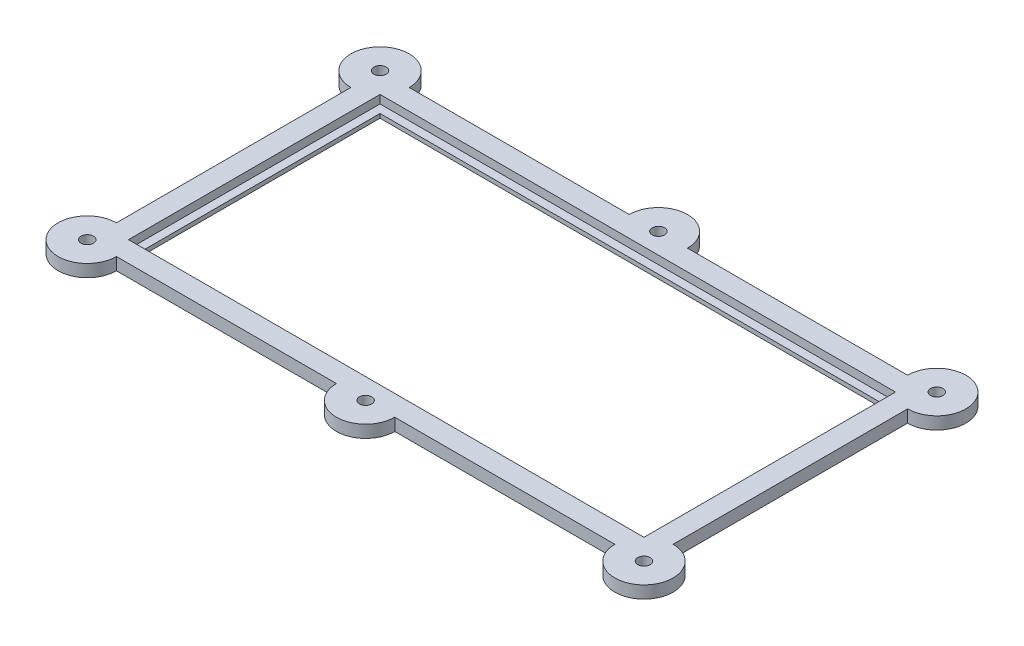
ISO-10303-21;
HEADER;
FILE_DESCRIPTION(('STEP AP214'),'2;1');
FILE_NAME('part.step','',(''),(''),'','','');
FILE_SCHEMA(('AUTOMOTIVE_DESIGN { 1 0 10303 214 1 1 1 1 }'));
ENDSEC;
DATA;
#1=APPLICATION_CONTEXT('core data for automotive mechanical design processes');
#2=APPLICATION_PROTOCOL_DEFINITION('international standard','automotive_design',2000,#1);
#3=PRODUCT_CONTEXT('',#1,'mechanical');
#4=PRODUCT('Part','Part','',(#3));
#5=PRODUCT_RELATED_PRODUCT_CATEGORY('part','',(#4));
#6=PRODUCT_DEFINITION_FORMATION('','',#4);
#7=PRODUCT_DEFINITION_CONTEXT('part definition',#1,'design');
#8=PRODUCT_DEFINITION('design','',#6,#7);
#9=PRODUCT_DEFINITION_SHAPE('','',#8);
#10=(LENGTH_UNIT() NAMED_UNIT(*) SI_UNIT(.MILLI.,.METRE.));
#11=(NAMED_UNIT(*) PLANE_ANGLE_UNIT() SI_UNIT($,.RADIAN.));
#12=(NAMED_UNIT(*) SI_UNIT($,.STERADIAN.) SOLID_ANGLE_UNIT());
#13=UNCERTAINTY_MEASURE_WITH_UNIT(LENGTH_MEASURE(1.E-05),#10,'distance_accuracy_value','');
#14=(GEOMETRIC_REPRESENTATION_CONTEXT(3) GLOBAL_UNCERTAINTY_ASSIGNED_CONTEXT((#13)) GLOBAL_UNIT_ASSIGNED_CONTEXT((#10,
#11,#12)) REPRESENTATION_CONTEXT('',''));
#15=CARTESIAN_POINT('',(0.,0.,0.));
#16=DIRECTION('',(0.,0.,1.));
#17=DIRECTION('',(1.,0.,0.));
#18=AXIS2_PLACEMENT_3D('',#15,#16,#17);
#19=CARTESIAN_POINT('',(33.75,1.,17.75));
#20=DIRECTION('',(0.,0.,-1.));
#21=DIRECTION('',(-1.,0.,0.));
#22=AXIS2_PLACEMENT_3D('',#19,#20,#21);
#23=PLANE('',#22);
#24=DIRECTION('',(-1.,0.,0.));
#25=VECTOR('',#24,1.);
#26=CARTESIAN_POINT('',(-33.75,-0.5,17.75));
#27=LINE('',#26,#25);
#28=CARTESIAN_POINT('',(-3.53553390593274,-0.5,17.75));
#29=VERTEX_POINT('',#28);
#30=CARTESIAN_POINT('',(-30.2144660940673,-0.5,17.75));
#31=VERTEX_POINT('',#30);
#32=EDGE_CURVE('E264',#29,#31,#27,.T.);
#33=ORIENTED_EDGE('',*,*,#32,.F.);
#34=DIRECTION('',(0.,1.,0.));
#35=VECTOR('',#34,1.);
#36=CARTESIAN_POINT('',(-3.53553390593274,-10.5,17.75));
#37=LINE('',#36,#35);
#38=CARTESIAN_POINT('',(-3.53553390593274,1.,17.75));
#39=VERTEX_POINT('',#38);
#40=EDGE_CURVE('E48',#29,#39,#37,.T.);
#41=ORIENTED_EDGE('',*,*,#40,.T.);
#42=DIRECTION('',(1.,0.,0.));
#43=VECTOR('',#42,1.);
#44=CARTESIAN_POINT('',(33.75,1.,17.75));
#45=LINE('',#44,#43);
#46=CARTESIAN_POINT('',(-30.2144660940673,1.,17.75));
#47=VERTEX_POINT('',#46);
#48=EDGE_CURVE('E186',#47,#39,#45,.T.);
#49=ORIENTED_EDGE('',*,*,#48,.F.);
#50=DIRECTION('',(0.,1.,0.));
#51=VECTOR('',#50,1.);
#52=CARTESIAN_POINT('',(-30.2144660940673,-10.5,17.75));
#53=LINE('',#52,#51);
#54=EDGE_CURVE('E362',#47,#31,#53,.F.);
#55=ORIENTED_EDGE('',*,*,#54,.T.);
#56=EDGE_LOOP('',(#33,#41,#49,#55));
#57=FACE_BOUND('',#56,.T.);
#58=ADVANCED_FACE('F33',(#57),#23,.F.);
#59=CARTESIAN_POINT('',(33.75,1.,-17.75));
#60=DIRECTION('',(0.,0.,1.));
#61=DIRECTION('',(1.,0.,0.));
#62=AXIS2_PLACEMENT_3D('',#59,#60,#61);
#63=PLANE('',#62);
#64=DIRECTION('',(1.,0.,0.));
#65=VECTOR('',#64,1.);
#66=CARTESIAN_POINT('',(33.75,-0.5,-17.75));
#67=LINE('',#66,#65);
#68=CARTESIAN_POINT('',(3.53553390593274,-0.5,-17.75));
#69=VERTEX_POINT('',#68);
#70=CARTESIAN_POINT('',(30.2144660940673,-0.5,-17.75));
#71=VERTEX_POINT('',#70);
#72=EDGE_CURVE('E269',#69,#71,#67,.T.);
#73=ORIENTED_EDGE('',*,*,#72,.F.);
#74=DIRECTION('',(0.,1.,0.));
#75=VECTOR('',#74,1.);
#76=CARTESIAN_POINT('',(3.53553390593274,-10.5,-17.75));
#77=LINE('',#76,#75);
#78=CARTESIAN_POINT('',(3.53553390593274,1.,-17.75));
#79=VERTEX_POINT('',#78);
#80=EDGE_CURVE('E56',#69,#79,#77,.T.);
#81=ORIENTED_EDGE('',*,*,#80,.T.);
#82=DIRECTION('',(-1.,0.,0.));
#83=VECTOR('',#82,1.);
#84=CARTESIAN_POINT('',(33.75,1.,-17.75));
#85=LINE('',#84,#83);
#86=CARTESIAN_POINT('',(30.2144660940673,1.,-17.75));
#87=VERTEX_POINT('',#86);
#88=EDGE_CURVE('E11',#87,#79,#85,.T.);
#89=ORIENTED_EDGE('',*,*,#88,.F.);
#90=DIRECTION('',(0.,1.,0.));
#91=VECTOR('',#90,1.);
#92=CARTESIAN_POINT('',(30.2144660940673,-10.5,-17.75));
#93=LINE('',#92,#91);
#94=EDGE_CURVE('E385',#87,#71,#93,.F.);
#95=ORIENTED_EDGE('',*,*,#94,.T.);
#96=EDGE_LOOP('',(#73,#81,#89,#95));
#97=FACE_BOUND('',#96,.T.);
#98=ADVANCED_FACE('F330',(#97),#63,.F.);
#99=CARTESIAN_POINT('',(0.,1.,0.));
#100=DIRECTION('',(0.,1.,0.));
#101=DIRECTION('',(0.,0.,1.));
#102=AXIS2_PLACEMENT_3D('',#99,#100,#101);
#103=PLANE('',#102);
#104=CARTESIAN_POINT('',(33.75,1.,-17.75));
#105=DIRECTION('',(0.,1.,0.));
#106=DIRECTION('',(0.,0.,1.));
#107=AXIS2_PLACEMENT_3D('',#104,#105,#106);
#108=CIRCLE('',#107,0.749999999999999);
#109=CARTESIAN_POINT('',(33.75,1.,-17.));
#110=VERTEX_POINT('',#109);
#111=EDGE_CURVE('E187',#110,#110,#108,.T.);
#112=ORIENTED_EDGE('',*,*,#111,.F.);
#113=EDGE_LOOP('',(#112));
#114=FACE_BOUND('',#113,.T.);
#115=CARTESIAN_POINT('',(33.75,1.,17.75));
#116=DIRECTION('',(0.,1.,0.));
#117=DIRECTION('',(0.,0.,1.));
#118=AXIS2_PLACEMENT_3D('',#115,#116,#117);
#119=CIRCLE('',#118,0.749999999999999);
#120=CARTESIAN_POINT('',(33.75,1.,18.5));
#121=VERTEX_POINT('',#120);
#122=EDGE_CURVE('E404',#121,#121,#119,.T.);
#123=ORIENTED_EDGE('',*,*,#122,.F.);
#124=EDGE_LOOP('',(#123));
#125=FACE_BOUND('',#124,.T.);
#126=CARTESIAN_POINT('',(-33.75,1.,17.75));
#127=DIRECTION('',(0.,1.,0.));
#128=DIRECTION('',(0.,0.,1.));
#129=AXIS2_PLACEMENT_3D('',#126,#127,#128);
#130=CIRCLE('',#129,0.749999999999999);
#131=CARTESIAN_POINT('',(-33.75,1.,18.5));
#132=VERTEX_POINT('',#131);
#133=EDGE_CURVE('E407',#132,#132,#130,.T.);
#134=ORIENTED_EDGE('',*,*,#133,.F.);
#135=EDGE_LOOP('',(#134));
#136=FACE_BOUND('',#135,.T.);
#137=CARTESIAN_POINT('',(0.,1.,-17.75));
#138=DIRECTION('',(0.,1.,0.));
#139=DIRECTION('',(0.,0.,1.));
#140=AXIS2_PLACEMENT_3D('',#137,#138,#139);
#141=CIRCLE('',#140,0.75);
#142=CARTESIAN_POINT('',(0.,1.,-17.));
#143=VERTEX_POINT('',#142);
#144=EDGE_CURVE('E410',#143,#143,#141,.T.);
#145=ORIENTED_EDGE('',*,*,#144,.F.);
#146=EDGE_LOOP('',(#145));
#147=FACE_BOUND('',#146,.T.);
#148=CARTESIAN_POINT('',(0.,1.,17.75));
#149=DIRECTION('',(0.,1.,0.));
#150=DIRECTION('',(0.,0.,1.));
#151=AXIS2_PLACEMENT_3D('',#148,#149,#150);
#152=CIRCLE('',#151,0.75);
#153=CARTESIAN_POINT('',(0.,1.,18.5));
#154=VERTEX_POINT('',#153);
#155=EDGE_CURVE('E413',#154,#154,#152,.T.);
#156=ORIENTED_EDGE('',*,*,#155,.F.);
#157=EDGE_LOOP('',(#156));
#158=FACE_BOUND('',#157,.T.);
#159=CARTESIAN_POINT('',(-33.75,1.,-17.75));
#160=DIRECTION('',(0.,1.,0.));
#161=DIRECTION('',(0.,0.,1.));
#162=AXIS2_PLACEMENT_3D('',#159,#160,#161);
#163=CIRCLE('',#162,0.749999999999999);
#164=CARTESIAN_POINT('',(-33.75,1.,-17.));
#165=VERTEX_POINT('',#164);
#166=EDGE_CURVE('E416',#165,#165,#163,.T.);
#167=ORIENTED_EDGE('',*,*,#166,.F.);
#168=EDGE_LOOP('',(#167));
#169=FACE_BOUND('',#168,.T.);
#170=DIRECTION('',(1.,0.,0.));
#171=VECTOR('',#170,1.);
#172=CARTESIAN_POINT('',(31.25,1.,15.25));
#173=LINE('',#172,#171);
#174=CARTESIAN_POINT('',(-31.25,1.,15.25));
#175=VERTEX_POINT('',#174);
#176=CARTESIAN_POINT('',(31.25,1.,15.25));
#177=VERTEX_POINT('',#176);
#178=EDGE_CURVE('E274',#175,#177,#173,.T.);
#179=ORIENTED_EDGE('',*,*,#178,.F.);
#180=DIRECTION('',(0.,0.,1.));
#181=VECTOR('',#180,1.);
#182=CARTESIAN_POINT('',(-31.25,1.,15.25));
#183=LINE('',#182,#181);
#184=CARTESIAN_POINT('',(-31.25,1.,-15.25));
#185=VERTEX_POINT('',#184);
#186=EDGE_CURVE('E272',#185,#175,#183,.T.);
#187=ORIENTED_EDGE('',*,*,#186,.F.);
#188=DIRECTION('',(-1.,0.,0.));
#189=VECTOR('',#188,1.);
#190=CARTESIAN_POINT('',(31.25,1.,-15.25));
#191=LINE('',#190,#189);
#192=CARTESIAN_POINT('',(31.25,1.,-15.25));
#193=VERTEX_POINT('',#192);
#194=EDGE_CURVE('E280',#193,#185,#191,.T.);
#195=ORIENTED_EDGE('',*,*,#194,.F.);
#196=DIRECTION('',(0.,0.,-1.));
#197=VECTOR('',#196,1.);
#198=CARTESIAN_POINT('',(31.25,1.,15.25));
#199=LINE('',#198,#197);
#200=EDGE_CURVE('E277',#177,#193,#199,.T.);
#201=ORIENTED_EDGE('',*,*,#200,.F.);
#202=EDGE_LOOP('',(#179,#187,#195,#201));
#203=FACE_BOUND('',#202,.T.);
#204=CARTESIAN_POINT('',(-33.75,1.,17.75));
#205=DIRECTION('',(0.,1.,0.));
#206=DIRECTION('',(0.,0.,1.));
#207=AXIS2_PLACEMENT_3D('',#204,#205,#206);
#208=CIRCLE('',#207,3.53553390593274);
#209=CARTESIAN_POINT('',(-33.75,1.,14.2144660940673));
#210=VERTEX_POINT('',#209);
#211=EDGE_CURVE('E363',#210,#47,#208,.T.);
#212=ORIENTED_EDGE('',*,*,#211,.T.);
#213=ORIENTED_EDGE('',*,*,#48,.T.);
#214=CARTESIAN_POINT('',(0.,1.,17.75));
#215=DIRECTION('',(0.,1.,0.));
#216=DIRECTION('',(0.,0.,1.));
#217=AXIS2_PLACEMENT_3D('',#214,#215,#216);
#218=CIRCLE('',#217,3.53553390593274);
#219=CARTESIAN_POINT('',(3.53553390593274,1.,17.75));
#220=VERTEX_POINT('',#219);
#221=EDGE_CURVE('E171',#39,#220,#218,.T.);
#222=ORIENTED_EDGE('',*,*,#221,.T.);
#223=CARTESIAN_POINT('',(30.2144660940673,1.,17.75));
#224=VERTEX_POINT('',#223);
#225=EDGE_CURVE('E183',#220,#224,#45,.T.);
#226=ORIENTED_EDGE('',*,*,#225,.T.);
#227=CARTESIAN_POINT('',(33.75,1.,17.75));
#228=DIRECTION('',(0.,1.,0.));
#229=DIRECTION('',(0.,0.,1.));
#230=AXIS2_PLACEMENT_3D('',#227,#228,#229);
#231=CIRCLE('',#230,3.53553390593274);
#232=CARTESIAN_POINT('',(33.75,1.,14.2144660940673));
#233=VERTEX_POINT('',#232);
#234=EDGE_CURVE('E371',#224,#233,#231,.T.);
#235=ORIENTED_EDGE('',*,*,#234,.T.);
#236=DIRECTION('',(0.,0.,-1.));
#237=VECTOR('',#236,1.);
#238=CARTESIAN_POINT('',(33.75,1.,17.75));
#239=LINE('',#238,#237);
#240=CARTESIAN_POINT('',(33.75,1.,-14.2144660940673));
#241=VERTEX_POINT('',#240);
#242=EDGE_CURVE('E194',#233,#241,#239,.T.);
#243=ORIENTED_EDGE('',*,*,#242,.T.);
#244=CARTESIAN_POINT('',(33.75,1.,-17.75));
#245=DIRECTION('',(0.,1.,0.));
#246=DIRECTION('',(0.,0.,1.));
#247=AXIS2_PLACEMENT_3D('',#244,#245,#246);
#248=CIRCLE('',#247,3.53553390593275);
#249=EDGE_CURVE('E380',#241,#87,#248,.T.);
#250=ORIENTED_EDGE('',*,*,#249,.T.);
#251=ORIENTED_EDGE('',*,*,#88,.T.);
#252=CARTESIAN_POINT('',(0.,1.,-17.75));
#253=DIRECTION('',(0.,1.,0.));
#254=DIRECTION('',(0.,0.,1.));
#255=AXIS2_PLACEMENT_3D('',#252,#253,#254);
#256=CIRCLE('',#255,3.53553390593274);
#257=CARTESIAN_POINT('',(-3.53553390593274,1.,-17.75));
#258=VERTEX_POINT('',#257);
#259=EDGE_CURVE('E208',#79,#258,#256,.T.);
#260=ORIENTED_EDGE('',*,*,#259,.T.);
#261=CARTESIAN_POINT('',(-30.2144660940673,1.,-17.75));
#262=VERTEX_POINT('',#261);
#263=EDGE_CURVE('E41',#258,#262,#85,.T.);
#264=ORIENTED_EDGE('',*,*,#263,.T.);
#265=CARTESIAN_POINT('',(-33.75,1.,-17.75));
#266=DIRECTION('',(0.,1.,0.));
#267=DIRECTION('',(0.,0.,1.));
#268=AXIS2_PLACEMENT_3D('',#265,#266,#267);
#269=CIRCLE('',#268,3.53553390593274);
#270=CARTESIAN_POINT('',(-33.75,1.,-14.2144660940673));
#271=VERTEX_POINT('',#270);
#272=EDGE_CURVE('E206',#262,#271,#269,.T.);
#273=ORIENTED_EDGE('',*,*,#272,.T.);
#274=DIRECTION('',(0.,0.,1.));
#275=VECTOR('',#274,1.);
#276=CARTESIAN_POINT('',(-33.75,1.,17.75));
#277=LINE('',#276,#275);
#278=EDGE_CURVE('E192',#271,#210,#277,.T.);
#279=ORIENTED_EDGE('',*,*,#278,.T.);
#280=EDGE_LOOP('',(#212,#213,#222,#226,#235,#243,#250,#251,#260,#264,#273,#279));
#281=FACE_BOUND('',#280,.T.);
#282=ADVANCED_FACE('F181',(#114,#125,#136,#147,#158,#169,#203,#281),#103,.T.);
#283=CARTESIAN_POINT('',(-33.75,1.,17.75));
#284=DIRECTION('',(1.,0.,0.));
#285=DIRECTION('',(0.,0.,-1.));
#286=AXIS2_PLACEMENT_3D('',#283,#284,#285);
#287=PLANE('',#286);
#288=DIRECTION('',(0.,0.,-1.));
#289=VECTOR('',#288,1.);
#290=CARTESIAN_POINT('',(-33.75,-0.5,-17.75));
#291=LINE('',#290,#289);
#292=CARTESIAN_POINT('',(-33.75,-0.5,14.2144660940673));
#293=VERTEX_POINT('',#292);
#294=CARTESIAN_POINT('',(-33.75,-0.5,-14.2144660940673));
#295=VERTEX_POINT('',#294);
#296=EDGE_CURVE('E267',#293,#295,#291,.T.);
#297=ORIENTED_EDGE('',*,*,#296,.F.);
#298=DIRECTION('',(0.,1.,0.));
#299=VECTOR('',#298,1.);
#300=CARTESIAN_POINT('',(-33.75,-10.5,14.2144660940673));
#301=LINE('',#300,#299);
#302=EDGE_CURVE('E354',#293,#210,#301,.T.);
#303=ORIENTED_EDGE('',*,*,#302,.T.);
#304=ORIENTED_EDGE('',*,*,#278,.F.);
#305=DIRECTION('',(0.,1.,0.));
#306=VECTOR('',#305,1.);
#307=CARTESIAN_POINT('',(-33.75,-10.5,-14.2144660940673));
#308=LINE('',#307,#306);
#309=EDGE_CURVE('E219',#271,#295,#308,.F.);
#310=ORIENTED_EDGE('',*,*,#309,.T.);
#311=EDGE_LOOP('',(#297,#303,#304,#310));
#312=FACE_BOUND('',#311,.T.);
#313=ADVANCED_FACE('F35',(#312),#287,.F.);
#314=ORIENTED_EDGE('',*,*,#225,.F.);
#315=DIRECTION('',(0.,1.,0.));
#316=VECTOR('',#315,1.);
#317=CARTESIAN_POINT('',(3.53553390593274,-10.5,17.75));
#318=LINE('',#317,#316);
#319=CARTESIAN_POINT('',(3.53553390593274,-0.5,17.75));
#320=VERTEX_POINT('',#319);
#321=EDGE_CURVE('E168',#320,#220,#318,.T.);
#322=ORIENTED_EDGE('',*,*,#321,.F.);
#323=CARTESIAN_POINT('',(30.2144660940673,-0.5,17.75));
#324=VERTEX_POINT('',#323);
#325=EDGE_CURVE('E265',#324,#320,#27,.T.);
#326=ORIENTED_EDGE('',*,*,#325,.F.);
#327=DIRECTION('',(0.,1.,0.));
#328=VECTOR('',#327,1.);
#329=CARTESIAN_POINT('',(30.2144660940673,-10.5,17.75));
#330=LINE('',#329,#328);
#331=EDGE_CURVE('E191',#324,#224,#330,.T.);
#332=ORIENTED_EDGE('',*,*,#331,.T.);
#333=EDGE_LOOP('',(#314,#322,#326,#332));
#334=FACE_BOUND('',#333,.T.);
#335=ADVANCED_FACE('F190',(#334),#23,.F.);
#336=CARTESIAN_POINT('',(33.75,1.,17.75));
#337=DIRECTION('',(-1.,0.,0.));
#338=DIRECTION('',(0.,0.,1.));
#339=AXIS2_PLACEMENT_3D('',#336,#337,#338);
#340=PLANE('',#339);
#341=ORIENTED_EDGE('',*,*,#242,.F.);
#342=DIRECTION('',(0.,1.,0.));
#343=VECTOR('',#342,1.);
#344=CARTESIAN_POINT('',(33.75,-10.5,14.2144660940673));
#345=LINE('',#344,#343);
#346=CARTESIAN_POINT('',(33.75,-0.5,14.2144660940673));
#347=VERTEX_POINT('',#346);
#348=EDGE_CURVE('E376',#233,#347,#345,.F.);
#349=ORIENTED_EDGE('',*,*,#348,.T.);
#350=DIRECTION('',(0.,0.,1.));
#351=VECTOR('',#350,1.);
#352=CARTESIAN_POINT('',(33.75,-0.5,17.75));
#353=LINE('',#352,#351);
#354=CARTESIAN_POINT('',(33.75,-0.5,-14.2144660940673));
#355=VERTEX_POINT('',#354);
#356=EDGE_CURVE('E261',#355,#347,#353,.T.);
#357=ORIENTED_EDGE('',*,*,#356,.F.);
#358=DIRECTION('',(0.,1.,0.));
#359=VECTOR('',#358,1.);
#360=CARTESIAN_POINT('',(33.75,-10.5,-14.2144660940673));
#361=LINE('',#360,#359);
#362=EDGE_CURVE('E221',#355,#241,#361,.T.);
#363=ORIENTED_EDGE('',*,*,#362,.T.);
#364=EDGE_LOOP('',(#341,#349,#357,#363));
#365=FACE_BOUND('',#364,.T.);
#366=ADVANCED_FACE('F340',(#365),#340,.F.);
#367=ORIENTED_EDGE('',*,*,#263,.F.);
#368=DIRECTION('',(0.,1.,0.));
#369=VECTOR('',#368,1.);
#370=CARTESIAN_POINT('',(-3.53553390593274,-10.5,-17.75));
#371=LINE('',#370,#369);
#372=CARTESIAN_POINT('',(-3.53553390593274,-0.5,-17.75));
#373=VERTEX_POINT('',#372);
#374=EDGE_CURVE('E395',#373,#258,#371,.T.);
#375=ORIENTED_EDGE('',*,*,#374,.F.);
#376=CARTESIAN_POINT('',(-30.2144660940673,-0.5,-17.75));
#377=VERTEX_POINT('',#376);
#378=EDGE_CURVE('E225',#377,#373,#67,.T.);
#379=ORIENTED_EDGE('',*,*,#378,.F.);
#380=DIRECTION('',(0.,1.,0.));
#381=VECTOR('',#380,1.);
#382=CARTESIAN_POINT('',(-30.2144660940673,-10.5,-17.75));
#383=LINE('',#382,#381);
#384=EDGE_CURVE('E216',#377,#262,#383,.T.);
#385=ORIENTED_EDGE('',*,*,#384,.T.);
#386=EDGE_LOOP('',(#367,#375,#379,#385));
#387=FACE_BOUND('',#386,.T.);
#388=ADVANCED_FACE('F223',(#387),#63,.F.);
#389=CARTESIAN_POINT('',(-31.25,1.,15.25));
#390=DIRECTION('',(1.,0.,0.));
#391=DIRECTION('',(0.,0.,-1.));
#392=AXIS2_PLACEMENT_3D('',#389,#390,#391);
#393=PLANE('',#392);
#394=DIRECTION('',(0.,0.,1.));
#395=VECTOR('',#394,1.);
#396=CARTESIAN_POINT('',(-31.25,0.,15.25));
#397=LINE('',#396,#395);
#398=CARTESIAN_POINT('',(-31.25,0.,-15.25));
#399=VERTEX_POINT('',#398);
#400=CARTESIAN_POINT('',(-31.25,0.,15.25));
#401=VERTEX_POINT('',#400);
#402=EDGE_CURVE('E271',#399,#401,#397,.T.);
#403=ORIENTED_EDGE('',*,*,#402,.F.);
#404=DIRECTION('',(0.,-1.,0.));
#405=VECTOR('',#404,1.);
#406=CARTESIAN_POINT('',(-31.25,1.,-15.25));
#407=LINE('',#406,#405);
#408=EDGE_CURVE('E282',#185,#399,#407,.T.);
#409=ORIENTED_EDGE('',*,*,#408,.F.);
#410=ORIENTED_EDGE('',*,*,#186,.T.);
#411=DIRECTION('',(0.,-1.,0.));
#412=VECTOR('',#411,1.);
#413=CARTESIAN_POINT('',(-31.25,1.,15.25));
#414=LINE('',#413,#412);
#415=EDGE_CURVE('E196',#175,#401,#414,.T.);
#416=ORIENTED_EDGE('',*,*,#415,.T.);
#417=EDGE_LOOP('',(#403,#409,#410,#416));
#418=FACE_BOUND('',#417,.T.);
#419=ADVANCED_FACE('F301',(#418),#393,.T.);
#420=CARTESIAN_POINT('',(31.25,1.,15.25));
#421=DIRECTION('',(0.,0.,-1.));
#422=DIRECTION('',(-1.,0.,0.));
#423=AXIS2_PLACEMENT_3D('',#420,#421,#422);
#424=PLANE('',#423);
#425=DIRECTION('',(1.,0.,0.));
#426=VECTOR('',#425,1.);
#427=CARTESIAN_POINT('',(31.25,0.,15.25));
#428=LINE('',#427,#426);
#429=CARTESIAN_POINT('',(31.25,0.,15.25));
#430=VERTEX_POINT('',#429);
#431=EDGE_CURVE('E285',#401,#430,#428,.T.);
#432=ORIENTED_EDGE('',*,*,#431,.F.);
#433=ORIENTED_EDGE('',*,*,#415,.F.);
#434=ORIENTED_EDGE('',*,*,#178,.T.);
#435=DIRECTION('',(0.,-1.,0.));
#436=VECTOR('',#435,1.);
#437=CARTESIAN_POINT('',(31.25,1.,15.25));
#438=LINE('',#437,#436);
#439=EDGE_CURVE('E296',#177,#430,#438,.T.);
#440=ORIENTED_EDGE('',*,*,#439,.T.);
#441=EDGE_LOOP('',(#432,#433,#434,#440));
#442=FACE_BOUND('',#441,.T.);
#443=ADVANCED_FACE('F317',(#442),#424,.T.);
#444=CARTESIAN_POINT('',(31.25,1.,15.25));
#445=DIRECTION('',(-1.,0.,0.));
#446=DIRECTION('',(0.,0.,1.));
#447=AXIS2_PLACEMENT_3D('',#444,#445,#446);
#448=PLANE('',#447);
#449=DIRECTION('',(0.,0.,-1.));
#450=VECTOR('',#449,1.);
#451=CARTESIAN_POINT('',(31.25,0.,15.25));
#452=LINE('',#451,#450);
#453=CARTESIAN_POINT('',(31.25,0.,-15.25));
#454=VERTEX_POINT('',#453);
#455=EDGE_CURVE('E288',#430,#454,#452,.T.);
#456=ORIENTED_EDGE('',*,*,#455,.F.);
#457=ORIENTED_EDGE('',*,*,#439,.F.);
#458=ORIENTED_EDGE('',*,*,#200,.T.);
#459=DIRECTION('',(0.,-1.,0.));
#460=VECTOR('',#459,1.);
#461=CARTESIAN_POINT('',(31.25,1.,-15.25));
#462=LINE('',#461,#460);
#463=EDGE_CURVE('E294',#193,#454,#462,.T.);
#464=ORIENTED_EDGE('',*,*,#463,.T.);
#465=EDGE_LOOP('',(#456,#457,#458,#464));
#466=FACE_BOUND('',#465,.T.);
#467=ADVANCED_FACE('F319',(#466),#448,.T.);
#468=CARTESIAN_POINT('',(31.25,1.,-15.25));
#469=DIRECTION('',(0.,0.,1.));
#470=DIRECTION('',(1.,0.,0.));
#471=AXIS2_PLACEMENT_3D('',#468,#469,#470);
#472=PLANE('',#471);
#473=DIRECTION('',(-1.,0.,0.));
#474=VECTOR('',#473,1.);
#475=CARTESIAN_POINT('',(31.25,0.,-15.25));
#476=LINE('',#475,#474);
#477=EDGE_CURVE('E275',#454,#399,#476,.T.);
#478=ORIENTED_EDGE('',*,*,#477,.F.);
#479=ORIENTED_EDGE('',*,*,#463,.F.);
#480=ORIENTED_EDGE('',*,*,#194,.T.);
#481=ORIENTED_EDGE('',*,*,#408,.T.);
#482=EDGE_LOOP('',(#478,#479,#480,#481));
#483=FACE_BOUND('',#482,.T.);
#484=ADVANCED_FACE('F312',(#483),#472,.T.);
#485=CARTESIAN_POINT('',(0.,-0.5,0.));
#486=DIRECTION('',(0.,1.,0.));
#487=DIRECTION('',(0.,0.,1.));
#488=AXIS2_PLACEMENT_3D('',#485,#486,#487);
#489=PLANE('',#488);
#490=CARTESIAN_POINT('',(33.75,-0.5,-17.75));
#491=DIRECTION('',(0.,1.,0.));
#492=DIRECTION('',(0.,0.,1.));
#493=AXIS2_PLACEMENT_3D('',#490,#491,#492);
#494=CIRCLE('',#493,0.749999999999999);
#495=CARTESIAN_POINT('',(33.75,-0.5,-17.));
#496=VERTEX_POINT('',#495);
#497=EDGE_CURVE('E422',#496,#496,#494,.T.);
#498=ORIENTED_EDGE('',*,*,#497,.T.);
#499=EDGE_LOOP('',(#498));
#500=FACE_BOUND('',#499,.T.);
#501=CARTESIAN_POINT('',(33.75,-0.5,17.75));
#502=DIRECTION('',(0.,1.,0.));
#503=DIRECTION('',(0.,0.,1.));
#504=AXIS2_PLACEMENT_3D('',#501,#502,#503);
#505=CIRCLE('',#504,0.749999999999999);
#506=CARTESIAN_POINT('',(33.75,-0.5,18.5));
#507=VERTEX_POINT('',#506);
#508=EDGE_CURVE('E430',#507,#507,#505,.T.);
#509=ORIENTED_EDGE('',*,*,#508,.T.);
#510=EDGE_LOOP('',(#509));
#511=FACE_BOUND('',#510,.T.);
#512=CARTESIAN_POINT('',(-33.75,-0.5,17.75));
#513=DIRECTION('',(0.,1.,0.));
#514=DIRECTION('',(0.,0.,1.));
#515=AXIS2_PLACEMENT_3D('',#512,#513,#514);
#516=CIRCLE('',#515,0.749999999999999);
#517=CARTESIAN_POINT('',(-33.75,-0.5,18.5));
#518=VERTEX_POINT('',#517);
#519=EDGE_CURVE('E426',#518,#518,#516,.T.);
#520=ORIENTED_EDGE('',*,*,#519,.T.);
#521=EDGE_LOOP('',(#520));
#522=FACE_BOUND('',#521,.T.);
#523=CARTESIAN_POINT('',(0.,-0.5,-17.75));
#524=DIRECTION('',(0.,1.,0.));
#525=DIRECTION('',(0.,0.,1.));
#526=AXIS2_PLACEMENT_3D('',#523,#524,#525);
#527=CIRCLE('',#526,0.75);
#528=CARTESIAN_POINT('',(0.,-0.5,-17.));
#529=VERTEX_POINT('',#528);
#530=EDGE_CURVE('E423',#529,#529,#527,.T.);
#531=ORIENTED_EDGE('',*,*,#530,.T.);
#532=EDGE_LOOP('',(#531));
#533=FACE_BOUND('',#532,.T.);
#534=CARTESIAN_POINT('',(0.,-0.5,17.75));
#535=DIRECTION('',(0.,1.,0.));
#536=DIRECTION('',(0.,0.,1.));
#537=AXIS2_PLACEMENT_3D('',#534,#535,#536);
#538=CIRCLE('',#537,0.75);
#539=CARTESIAN_POINT('',(0.,-0.5,18.5));
#540=VERTEX_POINT('',#539);
#541=EDGE_CURVE('E427',#540,#540,#538,.T.);
#542=ORIENTED_EDGE('',*,*,#541,.T.);
#543=EDGE_LOOP('',(#542));
#544=FACE_BOUND('',#543,.T.);
#545=CARTESIAN_POINT('',(-33.75,-0.5,-17.75));
#546=DIRECTION('',(0.,1.,0.));
#547=DIRECTION('',(0.,0.,1.));
#548=AXIS2_PLACEMENT_3D('',#545,#546,#547);
#549=CIRCLE('',#548,0.749999999999999);
#550=CARTESIAN_POINT('',(-33.75,-0.5,-17.));
#551=VERTEX_POINT('',#550);
#552=EDGE_CURVE('E419',#551,#551,#549,.T.);
#553=ORIENTED_EDGE('',*,*,#552,.T.);
#554=EDGE_LOOP('',(#553));
#555=FACE_BOUND('',#554,.T.);
#556=CARTESIAN_POINT('',(-33.75,-0.5,17.75));
#557=DIRECTION('',(0.,1.,0.));
#558=DIRECTION('',(0.,0.,1.));
#559=AXIS2_PLACEMENT_3D('',#556,#557,#558);
#560=CIRCLE('',#559,3.53553390593274);
#561=EDGE_CURVE('E359',#31,#293,#560,.F.);
#562=ORIENTED_EDGE('',*,*,#561,.T.);
#563=ORIENTED_EDGE('',*,*,#296,.T.);
#564=CARTESIAN_POINT('',(-33.75,-0.5,-17.75));
#565=DIRECTION('',(0.,1.,0.));
#566=DIRECTION('',(0.,0.,1.));
#567=AXIS2_PLACEMENT_3D('',#564,#565,#566);
#568=CIRCLE('',#567,3.53553390593274);
#569=EDGE_CURVE('E220',#295,#377,#568,.F.);
#570=ORIENTED_EDGE('',*,*,#569,.T.);
#571=ORIENTED_EDGE('',*,*,#378,.T.);
#572=CARTESIAN_POINT('',(0.,-0.5,-17.75));
#573=DIRECTION('',(0.,1.,0.));
#574=DIRECTION('',(0.,0.,1.));
#575=AXIS2_PLACEMENT_3D('',#572,#573,#574);
#576=CIRCLE('',#575,3.53553390593274);
#577=EDGE_CURVE('E366',#373,#69,#576,.F.);
#578=ORIENTED_EDGE('',*,*,#577,.T.);
#579=ORIENTED_EDGE('',*,*,#72,.T.);
#580=CARTESIAN_POINT('',(33.75,-0.5,-17.75));
#581=DIRECTION('',(0.,1.,0.));
#582=DIRECTION('',(0.,0.,1.));
#583=AXIS2_PLACEMENT_3D('',#580,#581,#582);
#584=CIRCLE('',#583,3.53553390593275);
#585=EDGE_CURVE('E382',#71,#355,#584,.F.);
#586=ORIENTED_EDGE('',*,*,#585,.T.);
#587=ORIENTED_EDGE('',*,*,#356,.T.);
#588=CARTESIAN_POINT('',(33.75,-0.5,17.75));
#589=DIRECTION('',(0.,1.,0.));
#590=DIRECTION('',(0.,0.,1.));
#591=AXIS2_PLACEMENT_3D('',#588,#589,#590);
#592=CIRCLE('',#591,3.53553390593274);
#593=EDGE_CURVE('E373',#347,#324,#592,.F.);
#594=ORIENTED_EDGE('',*,*,#593,.T.);
#595=ORIENTED_EDGE('',*,*,#325,.T.);
#596=CARTESIAN_POINT('',(0.,-0.5,17.75));
#597=DIRECTION('',(0.,1.,0.));
#598=DIRECTION('',(0.,0.,1.));
#599=AXIS2_PLACEMENT_3D('',#596,#597,#598);
#600=CIRCLE('',#599,3.53553390593274);
#601=EDGE_CURVE('E172',#320,#29,#600,.F.);
#602=ORIENTED_EDGE('',*,*,#601,.T.);
#603=ORIENTED_EDGE('',*,*,#32,.T.);
#604=EDGE_LOOP('',(#562,#563,#570,#571,#578,#579,#586,#587,#594,#595,#602,#603));
#605=FACE_BOUND('',#604,.T.);
#606=DIRECTION('',(0.,0.,-1.));
#607=VECTOR('',#606,1.);
#608=CARTESIAN_POINT('',(-30.25,-0.5,-14.25));
#609=LINE('',#608,#607);
#610=CARTESIAN_POINT('',(-30.25,-0.5,14.25));
#611=VERTEX_POINT('',#610);
#612=CARTESIAN_POINT('',(-30.25,-0.5,-14.25));
#613=VERTEX_POINT('',#612);
#614=EDGE_CURVE('E231',#611,#613,#609,.T.);
#615=ORIENTED_EDGE('',*,*,#614,.F.);
#616=DIRECTION('',(-1.,0.,0.));
#617=VECTOR('',#616,1.);
#618=CARTESIAN_POINT('',(30.25,-0.5,14.25));
#619=LINE('',#618,#617);
#620=CARTESIAN_POINT('',(30.25,-0.5,14.25));
#621=VERTEX_POINT('',#620);
#622=EDGE_CURVE('E239',#621,#611,#619,.T.);
#623=ORIENTED_EDGE('',*,*,#622,.F.);
#624=DIRECTION('',(0.,0.,1.));
#625=VECTOR('',#624,1.);
#626=CARTESIAN_POINT('',(30.25,-0.5,-14.25));
#627=LINE('',#626,#625);
#628=CARTESIAN_POINT('',(30.25,-0.5,-14.25));
#629=VERTEX_POINT('',#628);
#630=EDGE_CURVE('E236',#629,#621,#627,.T.);
#631=ORIENTED_EDGE('',*,*,#630,.F.);
#632=DIRECTION('',(1.,0.,0.));
#633=VECTOR('',#632,1.);
#634=CARTESIAN_POINT('',(30.25,-0.5,-14.25));
#635=LINE('',#634,#633);
#636=EDGE_CURVE('E233',#613,#629,#635,.T.);
#637=ORIENTED_EDGE('',*,*,#636,.F.);
#638=EDGE_LOOP('',(#615,#623,#631,#637));
#639=FACE_BOUND('',#638,.T.);
#640=ADVANCED_FACE('F326',(#500,#511,#522,#533,#544,#555,#605,#639),#489,.F.);
#641=CARTESIAN_POINT('',(0.,0.,0.));
#642=DIRECTION('',(0.,1.,0.));
#643=DIRECTION('',(0.,0.,1.));
#644=AXIS2_PLACEMENT_3D('',#641,#642,#643);
#645=PLANE('',#644);
#646=ORIENTED_EDGE('',*,*,#477,.T.);
#647=ORIENTED_EDGE('',*,*,#402,.T.);
#648=ORIENTED_EDGE('',*,*,#431,.T.);
#649=ORIENTED_EDGE('',*,*,#455,.T.);
#650=EDGE_LOOP('',(#646,#647,#648,#649));
#651=FACE_BOUND('',#650,.T.);
#652=DIRECTION('',(-1.,0.,0.));
#653=VECTOR('',#652,1.);
#654=CARTESIAN_POINT('',(30.25,0.,14.25));
#655=LINE('',#654,#653);
#656=CARTESIAN_POINT('',(30.25,0.,14.25));
#657=VERTEX_POINT('',#656);
#658=CARTESIAN_POINT('',(-30.25,0.,14.25));
#659=VERTEX_POINT('',#658);
#660=EDGE_CURVE('E234',#657,#659,#655,.T.);
#661=ORIENTED_EDGE('',*,*,#660,.T.);
#662=DIRECTION('',(0.,0.,-1.));
#663=VECTOR('',#662,1.);
#664=CARTESIAN_POINT('',(-30.25,0.,-14.25));
#665=LINE('',#664,#663);
#666=CARTESIAN_POINT('',(-30.25,0.,-14.25));
#667=VERTEX_POINT('',#666);
#668=EDGE_CURVE('E227',#659,#667,#665,.T.);
#669=ORIENTED_EDGE('',*,*,#668,.T.);
#670=DIRECTION('',(1.,0.,0.));
#671=VECTOR('',#670,1.);
#672=CARTESIAN_POINT('',(30.25,0.,-14.25));
#673=LINE('',#672,#671);
#674=CARTESIAN_POINT('',(30.25,0.,-14.25));
#675=VERTEX_POINT('',#674);
#676=EDGE_CURVE('E244',#667,#675,#673,.T.);
#677=ORIENTED_EDGE('',*,*,#676,.T.);
#678=DIRECTION('',(0.,0.,1.));
#679=VECTOR('',#678,1.);
#680=CARTESIAN_POINT('',(30.25,0.,-14.25));
#681=LINE('',#680,#679);
#682=EDGE_CURVE('E247',#675,#657,#681,.T.);
#683=ORIENTED_EDGE('',*,*,#682,.T.);
#684=EDGE_LOOP('',(#661,#669,#677,#683));
#685=FACE_BOUND('',#684,.T.);
#686=ADVANCED_FACE('F307',(#651,#685),#645,.T.);
#687=CARTESIAN_POINT('',(-30.25,-0.5,-14.25));
#688=DIRECTION('',(1.,0.,0.));
#689=DIRECTION('',(0.,0.,-1.));
#690=AXIS2_PLACEMENT_3D('',#687,#688,#689);
#691=PLANE('',#690);
#692=ORIENTED_EDGE('',*,*,#668,.F.);
#693=DIRECTION('',(0.,1.,0.));
#694=VECTOR('',#693,1.);
#695=CARTESIAN_POINT('',(-30.25,-0.5,14.25));
#696=LINE('',#695,#694);
#697=EDGE_CURVE('E241',#611,#659,#696,.T.);
#698=ORIENTED_EDGE('',*,*,#697,.F.);
#699=ORIENTED_EDGE('',*,*,#614,.T.);
#700=DIRECTION('',(0.,1.,0.));
#701=VECTOR('',#700,1.);
#702=CARTESIAN_POINT('',(-30.25,-0.5,-14.25));
#703=LINE('',#702,#701);
#704=EDGE_CURVE('E258',#613,#667,#703,.T.);
#705=ORIENTED_EDGE('',*,*,#704,.T.);
#706=EDGE_LOOP('',(#692,#698,#699,#705));
#707=FACE_BOUND('',#706,.T.);
#708=ADVANCED_FACE('F494',(#707),#691,.T.);
#709=CARTESIAN_POINT('',(30.25,-0.5,-14.25));
#710=DIRECTION('',(0.,0.,1.));
#711=DIRECTION('',(1.,0.,0.));
#712=AXIS2_PLACEMENT_3D('',#709,#710,#711);
#713=PLANE('',#712);
#714=ORIENTED_EDGE('',*,*,#676,.F.);
#715=ORIENTED_EDGE('',*,*,#704,.F.);
#716=ORIENTED_EDGE('',*,*,#636,.T.);
#717=DIRECTION('',(0.,1.,0.));
#718=VECTOR('',#717,1.);
#719=CARTESIAN_POINT('',(30.25,-0.5,-14.25));
#720=LINE('',#719,#718);
#721=EDGE_CURVE('E256',#629,#675,#720,.T.);
#722=ORIENTED_EDGE('',*,*,#721,.T.);
#723=EDGE_LOOP('',(#714,#715,#716,#722));
#724=FACE_BOUND('',#723,.T.);
#725=ADVANCED_FACE('F490',(#724),#713,.T.);
#726=CARTESIAN_POINT('',(30.25,-0.5,-14.25));
#727=DIRECTION('',(-1.,0.,0.));
#728=DIRECTION('',(0.,0.,1.));
#729=AXIS2_PLACEMENT_3D('',#726,#727,#728);
#730=PLANE('',#729);
#731=ORIENTED_EDGE('',*,*,#682,.F.);
#732=ORIENTED_EDGE('',*,*,#721,.F.);
#733=ORIENTED_EDGE('',*,*,#630,.T.);
#734=DIRECTION('',(0.,1.,0.));
#735=VECTOR('',#734,1.);
#736=CARTESIAN_POINT('',(30.25,-0.5,14.25));
#737=LINE('',#736,#735);
#738=EDGE_CURVE('E254',#621,#657,#737,.T.);
#739=ORIENTED_EDGE('',*,*,#738,.T.);
#740=EDGE_LOOP('',(#731,#732,#733,#739));
#741=FACE_BOUND('',#740,.T.);
#742=ADVANCED_FACE('F486',(#741),#730,.T.);
#743=CARTESIAN_POINT('',(30.25,-0.5,14.25));
#744=DIRECTION('',(0.,0.,-1.));
#745=DIRECTION('',(-1.,0.,0.));
#746=AXIS2_PLACEMENT_3D('',#743,#744,#745);
#747=PLANE('',#746);
#748=ORIENTED_EDGE('',*,*,#660,.F.);
#749=ORIENTED_EDGE('',*,*,#738,.F.);
#750=ORIENTED_EDGE('',*,*,#622,.T.);
#751=ORIENTED_EDGE('',*,*,#697,.T.);
#752=EDGE_LOOP('',(#748,#749,#750,#751));
#753=FACE_BOUND('',#752,.T.);
#754=ADVANCED_FACE('F483',(#753),#747,.T.);
#755=CARTESIAN_POINT('',(-33.75,-10.5,-17.75));
#756=DIRECTION('',(0.,1.,0.));
#757=DIRECTION('',(0.,0.,1.));
#758=AXIS2_PLACEMENT_3D('',#755,#756,#757);
#759=CYLINDRICAL_SURFACE('',#758,3.53553390593274);
#760=ORIENTED_EDGE('',*,*,#309,.F.);
#761=ORIENTED_EDGE('',*,*,#272,.F.);
#762=ORIENTED_EDGE('',*,*,#384,.F.);
#763=ORIENTED_EDGE('',*,*,#569,.F.);
#764=EDGE_LOOP('',(#760,#761,#762,#763));
#765=FACE_BOUND('',#764,.T.);
#766=ADVANCED_FACE('F214',(#765),#759,.T.);
#767=CARTESIAN_POINT('',(33.75,-10.5,-17.75));
#768=DIRECTION('',(0.,1.,0.));
#769=DIRECTION('',(0.,0.,1.));
#770=AXIS2_PLACEMENT_3D('',#767,#768,#769);
#771=CYLINDRICAL_SURFACE('',#770,3.53553390593275);
#772=ORIENTED_EDGE('',*,*,#362,.F.);
#773=ORIENTED_EDGE('',*,*,#585,.F.);
#774=ORIENTED_EDGE('',*,*,#94,.F.);
#775=ORIENTED_EDGE('',*,*,#249,.F.);
#776=EDGE_LOOP('',(#772,#773,#774,#775));
#777=FACE_BOUND('',#776,.T.);
#778=ADVANCED_FACE('F392',(#777),#771,.T.);
#779=CARTESIAN_POINT('',(33.75,-10.5,17.75));
#780=DIRECTION('',(0.,1.,0.));
#781=DIRECTION('',(0.,0.,1.));
#782=AXIS2_PLACEMENT_3D('',#779,#780,#781);
#783=CYLINDRICAL_SURFACE('',#782,3.53553390593274);
#784=ORIENTED_EDGE('',*,*,#331,.F.);
#785=ORIENTED_EDGE('',*,*,#593,.F.);
#786=ORIENTED_EDGE('',*,*,#348,.F.);
#787=ORIENTED_EDGE('',*,*,#234,.F.);
#788=EDGE_LOOP('',(#784,#785,#786,#787));
#789=FACE_BOUND('',#788,.T.);
#790=ADVANCED_FACE('F475',(#789),#783,.T.);
#791=CARTESIAN_POINT('',(-33.75,-10.5,17.75));
#792=DIRECTION('',(0.,1.,0.));
#793=DIRECTION('',(0.,0.,1.));
#794=AXIS2_PLACEMENT_3D('',#791,#792,#793);
#795=CYLINDRICAL_SURFACE('',#794,3.53553390593274);
#796=ORIENTED_EDGE('',*,*,#302,.F.);
#797=ORIENTED_EDGE('',*,*,#561,.F.);
#798=ORIENTED_EDGE('',*,*,#54,.F.);
#799=ORIENTED_EDGE('',*,*,#211,.F.);
#800=EDGE_LOOP('',(#796,#797,#798,#799));
#801=FACE_BOUND('',#800,.T.);
#802=ADVANCED_FACE('F472',(#801),#795,.T.);
#803=CARTESIAN_POINT('',(0.,-10.5,-17.75));
#804=DIRECTION('',(0.,1.,0.));
#805=DIRECTION('',(0.,0.,1.));
#806=AXIS2_PLACEMENT_3D('',#803,#804,#805);
#807=CYLINDRICAL_SURFACE('',#806,3.53553390593274);
#808=ORIENTED_EDGE('',*,*,#577,.F.);
#809=ORIENTED_EDGE('',*,*,#374,.T.);
#810=ORIENTED_EDGE('',*,*,#259,.F.);
#811=ORIENTED_EDGE('',*,*,#80,.F.);
#812=EDGE_LOOP('',(#808,#809,#810,#811));
#813=FACE_BOUND('',#812,.T.);
#814=ADVANCED_FACE('F469',(#813),#807,.T.);
#815=CARTESIAN_POINT('',(0.,-10.5,17.75));
#816=DIRECTION('',(0.,1.,0.));
#817=DIRECTION('',(0.,0.,1.));
#818=AXIS2_PLACEMENT_3D('',#815,#816,#817);
#819=CYLINDRICAL_SURFACE('',#818,3.53553390593274);
#820=ORIENTED_EDGE('',*,*,#601,.F.);
#821=ORIENTED_EDGE('',*,*,#321,.T.);
#822=ORIENTED_EDGE('',*,*,#221,.F.);
#823=ORIENTED_EDGE('',*,*,#40,.F.);
#824=EDGE_LOOP('',(#820,#821,#822,#823));
#825=FACE_BOUND('',#824,.T.);
#826=ADVANCED_FACE('F170',(#825),#819,.T.);
#827=CARTESIAN_POINT('',(-33.75,-0.5,-17.75));
#828=DIRECTION('',(0.,1.,0.));
#829=DIRECTION('',(0.,0.,1.));
#830=AXIS2_PLACEMENT_3D('',#827,#828,#829);
#831=CYLINDRICAL_SURFACE('',#830,0.749999999999999);
#832=ORIENTED_EDGE('',*,*,#166,.T.);
#833=EDGE_LOOP('',(#832));
#834=FACE_BOUND('',#833,.T.);
#835=ORIENTED_EDGE('',*,*,#552,.F.);
#836=EDGE_LOOP('',(#835));
#837=FACE_BOUND('',#836,.T.);
#838=ADVANCED_FACE('F443',(#834,#837),#831,.F.);
#839=CARTESIAN_POINT('',(0.,-0.5,17.75));
#840=DIRECTION('',(0.,1.,0.));
#841=DIRECTION('',(0.,0.,1.));
#842=AXIS2_PLACEMENT_3D('',#839,#840,#841);
#843=CYLINDRICAL_SURFACE('',#842,0.75);
#844=ORIENTED_EDGE('',*,*,#155,.T.);
#845=EDGE_LOOP('',(#844));
#846=FACE_BOUND('',#845,.T.);
#847=ORIENTED_EDGE('',*,*,#541,.F.);
#848=EDGE_LOOP('',(#847));
#849=FACE_BOUND('',#848,.T.);
#850=ADVANCED_FACE('F440',(#846,#849),#843,.F.);
#851=CARTESIAN_POINT('',(0.,-0.5,-17.75));
#852=DIRECTION('',(0.,1.,0.));
#853=DIRECTION('',(0.,0.,1.));
#854=AXIS2_PLACEMENT_3D('',#851,#852,#853);
#855=CYLINDRICAL_SURFACE('',#854,0.75);
#856=ORIENTED_EDGE('',*,*,#144,.T.);
#857=EDGE_LOOP('',(#856));
#858=FACE_BOUND('',#857,.T.);
#859=ORIENTED_EDGE('',*,*,#530,.F.);
#860=EDGE_LOOP('',(#859));
#861=FACE_BOUND('',#860,.T.);
#862=ADVANCED_FACE('F442',(#858,#861),#855,.F.);
#863=CARTESIAN_POINT('',(-33.75,-0.5,17.75));
#864=DIRECTION('',(0.,1.,0.));
#865=DIRECTION('',(0.,0.,1.));
#866=AXIS2_PLACEMENT_3D('',#863,#864,#865);
#867=CYLINDRICAL_SURFACE('',#866,0.749999999999999);
#868=ORIENTED_EDGE('',*,*,#133,.T.);
#869=EDGE_LOOP('',(#868));
#870=FACE_BOUND('',#869,.T.);
#871=ORIENTED_EDGE('',*,*,#519,.F.);
#872=EDGE_LOOP('',(#871));
#873=FACE_BOUND('',#872,.T.);
#874=ADVANCED_FACE('F450',(#870,#873),#867,.F.);
#875=CARTESIAN_POINT('',(33.75,-0.5,17.75));
#876=DIRECTION('',(0.,1.,0.));
#877=DIRECTION('',(0.,0.,1.));
#878=AXIS2_PLACEMENT_3D('',#875,#876,#877);
#879=CYLINDRICAL_SURFACE('',#878,0.749999999999999);
#880=ORIENTED_EDGE('',*,*,#122,.T.);
#881=EDGE_LOOP('',(#880));
#882=FACE_BOUND('',#881,.T.);
#883=ORIENTED_EDGE('',*,*,#508,.F.);
#884=EDGE_LOOP('',(#883));
#885=FACE_BOUND('',#884,.T.);
#886=ADVANCED_FACE('F459',(#882,#885),#879,.F.);
#887=CARTESIAN_POINT('',(33.75,-0.5,-17.75));
#888=DIRECTION('',(0.,1.,0.));
#889=DIRECTION('',(0.,0.,1.));
#890=AXIS2_PLACEMENT_3D('',#887,#888,#889);
#891=CYLINDRICAL_SURFACE('',#890,0.749999999999999);
#892=ORIENTED_EDGE('',*,*,#111,.T.);
#893=EDGE_LOOP('',(#892));
#894=FACE_BOUND('',#893,.T.);
#895=ORIENTED_EDGE('',*,*,#497,.F.);
#896=EDGE_LOOP('',(#895));
#897=FACE_BOUND('',#896,.T.);
#898=ADVANCED_FACE('F456',(#894,#897),#891,.F.);
#899=CLOSED_SHELL('',(#58,#98,#282,#313,#335,#366,#388,#419,#443,#467,#484,#640,#686,#708,#725,
#742,#754,#766,#778,#790,#802,#814,#826,#838,#850,#862,#874,#886,#898));
#900=MANIFOLD_SOLID_BREP('B2',#899);
#901=ADVANCED_BREP_SHAPE_REPRESENTATION('',(#18,#900),#14);
#902=SHAPE_DEFINITION_REPRESENTATION(#9,#901);
ENDSEC;
END-ISO-10303-21;
